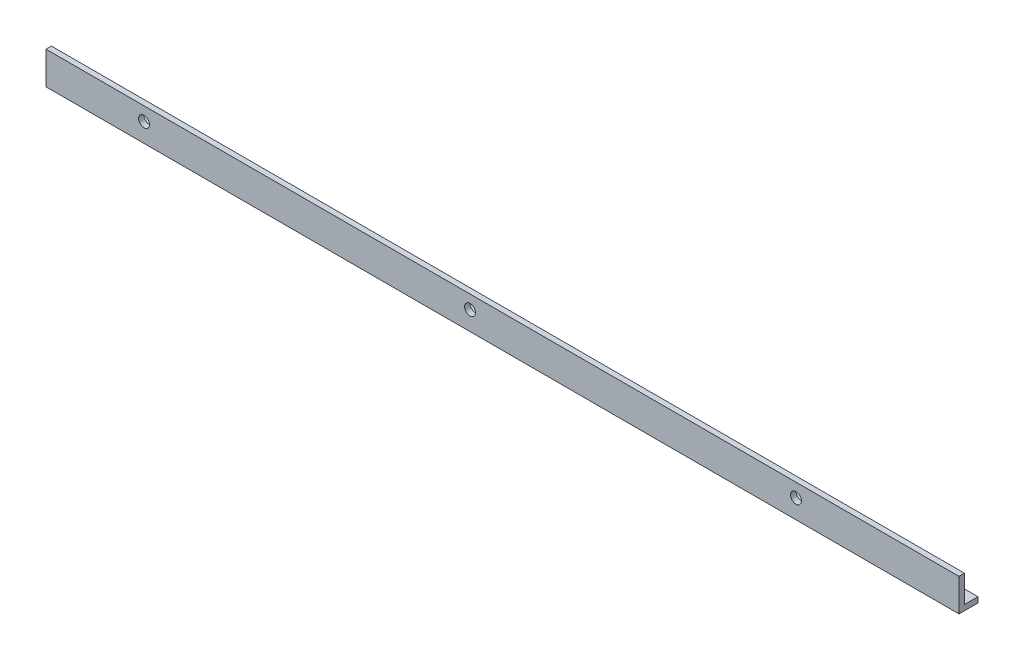
ISO-10303-21;
HEADER;
FILE_DESCRIPTION(('STEP AP214'),'2;1');
FILE_NAME('part.step','',(''),(''),'','','');
FILE_SCHEMA(('AUTOMOTIVE_DESIGN { 1 0 10303 214 1 1 1 1 }'));
ENDSEC;
DATA;
#1=APPLICATION_CONTEXT('core data for automotive mechanical design processes');
#2=APPLICATION_PROTOCOL_DEFINITION('international standard','automotive_design',2000,#1);
#3=PRODUCT_CONTEXT('',#1,'mechanical');
#4=PRODUCT('Part','Part','',(#3));
#5=PRODUCT_RELATED_PRODUCT_CATEGORY('part','',(#4));
#6=PRODUCT_DEFINITION_FORMATION('','',#4);
#7=PRODUCT_DEFINITION_CONTEXT('part definition',#1,'design');
#8=PRODUCT_DEFINITION('design','',#6,#7);
#9=PRODUCT_DEFINITION_SHAPE('','',#8);
#10=(LENGTH_UNIT() NAMED_UNIT(*) SI_UNIT(.MILLI.,.METRE.));
#11=(NAMED_UNIT(*) PLANE_ANGLE_UNIT() SI_UNIT($,.RADIAN.));
#12=(NAMED_UNIT(*) SI_UNIT($,.STERADIAN.) SOLID_ANGLE_UNIT());
#13=UNCERTAINTY_MEASURE_WITH_UNIT(LENGTH_MEASURE(1.E-05),#10,'distance_accuracy_value','');
#14=(GEOMETRIC_REPRESENTATION_CONTEXT(3) GLOBAL_UNCERTAINTY_ASSIGNED_CONTEXT((#13)) GLOBAL_UNIT_ASSIGNED_CONTEXT((#10,
#11,#12)) REPRESENTATION_CONTEXT('',''));
#15=CARTESIAN_POINT('',(0.,0.,0.));
#16=DIRECTION('',(0.,0.,1.));
#17=DIRECTION('',(1.,0.,0.));
#18=AXIS2_PLACEMENT_3D('',#15,#16,#17);
#19=CARTESIAN_POINT('',(0.,0.,0.));
#20=DIRECTION('',(0.,0.,1.));
#21=DIRECTION('',(1.,0.,0.));
#22=AXIS2_PLACEMENT_3D('',#19,#20,#21);
#23=PLANE('',#22);
#24=CARTESIAN_POINT('',(-39.88,1.98,0.));
#25=DIRECTION('',(0.,0.,-1.));
#26=DIRECTION('',(-1.,0.,0.));
#27=AXIS2_PLACEMENT_3D('',#24,#25,#26);
#28=CIRCLE('',#27,0.999999999999998);
#29=CARTESIAN_POINT('',(-40.88,1.98,0.));
#30=VERTEX_POINT('',#29);
#31=EDGE_CURVE('E124',#30,#30,#28,.T.);
#32=ORIENTED_EDGE('',*,*,#31,.F.);
#33=EDGE_LOOP('',(#32));
#34=FACE_BOUND('',#33,.T.);
#35=CARTESIAN_POINT('',(20.12,1.98,0.));
#36=DIRECTION('',(0.,0.,1.));
#37=DIRECTION('',(1.,0.,0.));
#38=AXIS2_PLACEMENT_3D('',#35,#36,#37);
#39=CIRCLE('',#38,1.);
#40=CARTESIAN_POINT('',(21.12,1.98,0.));
#41=VERTEX_POINT('',#40);
#42=EDGE_CURVE('E156',#41,#41,#39,.T.);
#43=ORIENTED_EDGE('',*,*,#42,.T.);
#44=EDGE_LOOP('',(#43));
#45=FACE_BOUND('',#44,.T.);
#46=CARTESIAN_POINT('',(80.12,1.98,0.));
#47=DIRECTION('',(0.,0.,1.));
#48=DIRECTION('',(1.,0.,0.));
#49=AXIS2_PLACEMENT_3D('',#46,#47,#48);
#50=CIRCLE('',#49,0.999999999999998);
#51=CARTESIAN_POINT('',(81.12,1.98,0.));
#52=VERTEX_POINT('',#51);
#53=EDGE_CURVE('E149',#52,#52,#50,.T.);
#54=ORIENTED_EDGE('',*,*,#53,.T.);
#55=EDGE_LOOP('',(#54));
#56=FACE_BOUND('',#55,.T.);
#57=DIRECTION('',(1.,0.,0.));
#58=VECTOR('',#57,1.);
#59=CARTESIAN_POINT('',(50.12,-0.519999999999996,0.));
#60=LINE('',#59,#58);
#61=CARTESIAN_POINT('',(-57.93,-0.519999999999996,0.));
#62=VERTEX_POINT('',#61);
#63=CARTESIAN_POINT('',(110.12,-0.519999999999996,0.));
#64=VERTEX_POINT('',#63);
#65=EDGE_CURVE('E52',#62,#64,#60,.T.);
#66=ORIENTED_EDGE('',*,*,#65,.F.);
#67=DIRECTION('',(0.,-1.,0.));
#68=VECTOR('',#67,1.);
#69=CARTESIAN_POINT('',(-57.93,4.48,0.));
#70=LINE('',#69,#68);
#71=CARTESIAN_POINT('',(-57.93,4.48,0.));
#72=VERTEX_POINT('',#71);
#73=EDGE_CURVE('E103',#72,#62,#70,.T.);
#74=ORIENTED_EDGE('',*,*,#73,.F.);
#75=DIRECTION('',(-1.,0.,0.));
#76=VECTOR('',#75,1.);
#77=CARTESIAN_POINT('',(-9.87999999999999,4.48,0.));
#78=LINE('',#77,#76);
#79=CARTESIAN_POINT('',(110.12,4.48,0.));
#80=VERTEX_POINT('',#79);
#81=EDGE_CURVE('E168',#80,#72,#78,.T.);
#82=ORIENTED_EDGE('',*,*,#81,.F.);
#83=DIRECTION('',(0.,1.,0.));
#84=VECTOR('',#83,1.);
#85=CARTESIAN_POINT('',(110.12,8.48000000000001,0.));
#86=LINE('',#85,#84);
#87=EDGE_CURVE('E180',#64,#80,#86,.T.);
#88=ORIENTED_EDGE('',*,*,#87,.F.);
#89=EDGE_LOOP('',(#66,#74,#82,#88));
#90=FACE_BOUND('',#89,.T.);
#91=ADVANCED_FACE('F43',(#34,#45,#56,#90),#23,.F.);
#92=CARTESIAN_POINT('',(-14.6,-1.52,1.));
#93=DIRECTION('',(0.,1.,0.));
#94=DIRECTION('',(0.,0.,1.));
#95=AXIS2_PLACEMENT_3D('',#92,#93,#94);
#96=PLANE('',#95);
#97=DIRECTION('',(1.,0.,0.));
#98=VECTOR('',#97,1.);
#99=CARTESIAN_POINT('',(-14.6,-1.52,1.));
#100=LINE('',#99,#98);
#101=CARTESIAN_POINT('',(-57.93,-1.52,1.00000000000001));
#102=VERTEX_POINT('',#101);
#103=CARTESIAN_POINT('',(110.12,-1.52,1.));
#104=VERTEX_POINT('',#103);
#105=EDGE_CURVE('E11',#102,#104,#100,.T.);
#106=ORIENTED_EDGE('',*,*,#105,.F.);
#107=DIRECTION('',(0.,0.,1.));
#108=VECTOR('',#107,1.);
#109=CARTESIAN_POINT('',(-57.93,-1.52,-2.5));
#110=LINE('',#109,#108);
#111=CARTESIAN_POINT('',(-57.93,-1.52,-2.5));
#112=VERTEX_POINT('',#111);
#113=EDGE_CURVE('E113',#112,#102,#110,.T.);
#114=ORIENTED_EDGE('',*,*,#113,.F.);
#115=DIRECTION('',(1.,0.,0.));
#116=VECTOR('',#115,1.);
#117=CARTESIAN_POINT('',(-9.87999999999999,-1.52,-2.5));
#118=LINE('',#117,#116);
#119=CARTESIAN_POINT('',(110.12,-1.52,-2.5));
#120=VERTEX_POINT('',#119);
#121=EDGE_CURVE('E102',#112,#120,#118,.T.);
#122=ORIENTED_EDGE('',*,*,#121,.T.);
#123=DIRECTION('',(0.,0.,-1.));
#124=VECTOR('',#123,1.);
#125=CARTESIAN_POINT('',(110.12,-1.52,-5.));
#126=LINE('',#125,#124);
#127=EDGE_CURVE('E174',#104,#120,#126,.T.);
#128=ORIENTED_EDGE('',*,*,#127,.F.);
#129=EDGE_LOOP('',(#106,#114,#122,#128));
#130=FACE_BOUND('',#129,.T.);
#131=ADVANCED_FACE('F45',(#130),#96,.F.);
#132=CARTESIAN_POINT('',(0.,0.,1.));
#133=DIRECTION('',(0.,0.,1.));
#134=DIRECTION('',(1.,0.,0.));
#135=AXIS2_PLACEMENT_3D('',#132,#133,#134);
#136=PLANE('',#135);
#137=CARTESIAN_POINT('',(-39.88,1.98,1.00000000000001));
#138=DIRECTION('',(0.,0.,-1.));
#139=DIRECTION('',(-1.,0.,0.));
#140=AXIS2_PLACEMENT_3D('',#137,#138,#139);
#141=CIRCLE('',#140,0.999999999999998);
#142=CARTESIAN_POINT('',(-40.88,1.98,1.00000000000001));
#143=VERTEX_POINT('',#142);
#144=EDGE_CURVE('E120',#143,#143,#141,.T.);
#145=ORIENTED_EDGE('',*,*,#144,.T.);
#146=EDGE_LOOP('',(#145));
#147=FACE_BOUND('',#146,.T.);
#148=CARTESIAN_POINT('',(20.12,1.98,1.));
#149=DIRECTION('',(0.,0.,1.));
#150=DIRECTION('',(1.,0.,0.));
#151=AXIS2_PLACEMENT_3D('',#148,#149,#150);
#152=CIRCLE('',#151,1.);
#153=CARTESIAN_POINT('',(21.12,1.98,1.));
#154=VERTEX_POINT('',#153);
#155=EDGE_CURVE('E145',#154,#154,#152,.T.);
#156=ORIENTED_EDGE('',*,*,#155,.F.);
#157=EDGE_LOOP('',(#156));
#158=FACE_BOUND('',#157,.T.);
#159=CARTESIAN_POINT('',(80.12,1.98,1.));
#160=DIRECTION('',(0.,0.,1.));
#161=DIRECTION('',(1.,0.,0.));
#162=AXIS2_PLACEMENT_3D('',#159,#160,#161);
#163=CIRCLE('',#162,0.999999999999998);
#164=CARTESIAN_POINT('',(81.12,1.98,1.));
#165=VERTEX_POINT('',#164);
#166=EDGE_CURVE('E144',#165,#165,#163,.T.);
#167=ORIENTED_EDGE('',*,*,#166,.F.);
#168=EDGE_LOOP('',(#167));
#169=FACE_BOUND('',#168,.T.);
#170=DIRECTION('',(1.,0.,0.));
#171=VECTOR('',#170,1.);
#172=CARTESIAN_POINT('',(-9.87999999999999,4.48,1.));
#173=LINE('',#172,#171);
#174=CARTESIAN_POINT('',(-57.93,4.48,1.));
#175=VERTEX_POINT('',#174);
#176=CARTESIAN_POINT('',(110.12,4.48,1.));
#177=VERTEX_POINT('',#176);
#178=EDGE_CURVE('E160',#175,#177,#173,.T.);
#179=ORIENTED_EDGE('',*,*,#178,.F.);
#180=DIRECTION('',(0.,1.,0.));
#181=VECTOR('',#180,1.);
#182=CARTESIAN_POINT('',(-57.93,-1.52,1.00000000000001));
#183=LINE('',#182,#181);
#184=EDGE_CURVE('E130',#102,#175,#183,.T.);
#185=ORIENTED_EDGE('',*,*,#184,.F.);
#186=ORIENTED_EDGE('',*,*,#105,.T.);
#187=DIRECTION('',(0.,-1.,0.));
#188=VECTOR('',#187,1.);
#189=CARTESIAN_POINT('',(110.12,-1.52,1.));
#190=LINE('',#189,#188);
#191=EDGE_CURVE('E171',#177,#104,#190,.T.);
#192=ORIENTED_EDGE('',*,*,#191,.F.);
#193=EDGE_LOOP('',(#179,#185,#186,#192));
#194=FACE_BOUND('',#193,.T.);
#195=ADVANCED_FACE('F191',(#147,#158,#169,#194),#136,.T.);
#196=CARTESIAN_POINT('',(50.12,-0.519999999999996,-5.));
#197=DIRECTION('',(0.,-1.,0.));
#198=DIRECTION('',(1.,0.,0.));
#199=AXIS2_PLACEMENT_3D('',#196,#197,#198);
#200=PLANE('',#199);
#201=DIRECTION('',(0.,0.,1.));
#202=VECTOR('',#201,1.);
#203=CARTESIAN_POINT('',(110.12,-0.519999999999996,0.));
#204=LINE('',#203,#202);
#205=CARTESIAN_POINT('',(110.12,-0.519999999999996,-2.5));
#206=VERTEX_POINT('',#205);
#207=EDGE_CURVE('E59',#206,#64,#204,.T.);
#208=ORIENTED_EDGE('',*,*,#207,.F.);
#209=DIRECTION('',(1.,0.,0.));
#210=VECTOR('',#209,1.);
#211=CARTESIAN_POINT('',(-9.87999999999999,-0.519999999999996,-2.5));
#212=LINE('',#211,#210);
#213=CARTESIAN_POINT('',(-57.93,-0.519999999999996,-2.5));
#214=VERTEX_POINT('',#213);
#215=EDGE_CURVE('E95',#214,#206,#212,.T.);
#216=ORIENTED_EDGE('',*,*,#215,.F.);
#217=DIRECTION('',(0.,0.,-1.));
#218=VECTOR('',#217,1.);
#219=CARTESIAN_POINT('',(-57.93,-0.519999999999996,0.));
#220=LINE('',#219,#218);
#221=EDGE_CURVE('E99',#62,#214,#220,.T.);
#222=ORIENTED_EDGE('',*,*,#221,.F.);
#223=ORIENTED_EDGE('',*,*,#65,.T.);
#224=EDGE_LOOP('',(#208,#216,#222,#223));
#225=FACE_BOUND('',#224,.T.);
#226=ADVANCED_FACE('F97',(#225),#200,.F.);
#227=CARTESIAN_POINT('',(110.12,0.,0.));
#228=DIRECTION('',(-1.,0.,0.));
#229=DIRECTION('',(0.,0.,1.));
#230=AXIS2_PLACEMENT_3D('',#227,#228,#229);
#231=PLANE('',#230);
#232=ORIENTED_EDGE('',*,*,#127,.T.);
#233=DIRECTION('',(0.,1.,0.));
#234=VECTOR('',#233,1.);
#235=CARTESIAN_POINT('',(110.12,-1.52,-2.5));
#236=LINE('',#235,#234);
#237=EDGE_CURVE('E140',#120,#206,#236,.T.);
#238=ORIENTED_EDGE('',*,*,#237,.T.);
#239=ORIENTED_EDGE('',*,*,#207,.T.);
#240=ORIENTED_EDGE('',*,*,#87,.T.);
#241=DIRECTION('',(0.,0.,-1.));
#242=VECTOR('',#241,1.);
#243=CARTESIAN_POINT('',(110.12,4.48,0.));
#244=LINE('',#243,#242);
#245=EDGE_CURVE('E164',#177,#80,#244,.T.);
#246=ORIENTED_EDGE('',*,*,#245,.F.);
#247=ORIENTED_EDGE('',*,*,#191,.T.);
#248=EDGE_LOOP('',(#232,#238,#239,#240,#246,#247));
#249=FACE_BOUND('',#248,.T.);
#250=ADVANCED_FACE('F187',(#249),#231,.F.);
#251=CARTESIAN_POINT('',(0.,4.48,0.));
#252=DIRECTION('',(0.,1.,0.));
#253=DIRECTION('',(0.,0.,1.));
#254=AXIS2_PLACEMENT_3D('',#251,#252,#253);
#255=PLANE('',#254);
#256=ORIENTED_EDGE('',*,*,#81,.T.);
#257=DIRECTION('',(0.,0.,-1.));
#258=VECTOR('',#257,1.);
#259=CARTESIAN_POINT('',(-57.93,4.48,1.));
#260=LINE('',#259,#258);
#261=EDGE_CURVE('E134',#175,#72,#260,.T.);
#262=ORIENTED_EDGE('',*,*,#261,.F.);
#263=ORIENTED_EDGE('',*,*,#178,.T.);
#264=ORIENTED_EDGE('',*,*,#245,.T.);
#265=EDGE_LOOP('',(#256,#262,#263,#264));
#266=FACE_BOUND('',#265,.T.);
#267=ADVANCED_FACE('F189',(#266),#255,.T.);
#268=CARTESIAN_POINT('',(80.12,1.98,-5.));
#269=DIRECTION('',(0.,0.,1.));
#270=DIRECTION('',(1.,0.,0.));
#271=AXIS2_PLACEMENT_3D('',#268,#269,#270);
#272=CYLINDRICAL_SURFACE('',#271,0.999999999999998);
#273=ORIENTED_EDGE('',*,*,#166,.T.);
#274=EDGE_LOOP('',(#273));
#275=FACE_BOUND('',#274,.T.);
#276=ORIENTED_EDGE('',*,*,#53,.F.);
#277=EDGE_LOOP('',(#276));
#278=FACE_BOUND('',#277,.T.);
#279=ADVANCED_FACE('F214',(#275,#278),#272,.F.);
#280=CARTESIAN_POINT('',(20.12,1.98,-5.));
#281=DIRECTION('',(0.,0.,1.));
#282=DIRECTION('',(1.,0.,0.));
#283=AXIS2_PLACEMENT_3D('',#280,#281,#282);
#284=CYLINDRICAL_SURFACE('',#283,1.);
#285=ORIENTED_EDGE('',*,*,#155,.T.);
#286=EDGE_LOOP('',(#285));
#287=FACE_BOUND('',#286,.T.);
#288=ORIENTED_EDGE('',*,*,#42,.F.);
#289=EDGE_LOOP('',(#288));
#290=FACE_BOUND('',#289,.T.);
#291=ADVANCED_FACE('F217',(#287,#290),#284,.F.);
#292=CARTESIAN_POINT('',(-9.87999999999999,-1.52,-2.5));
#293=DIRECTION('',(0.,0.,1.));
#294=DIRECTION('',(1.,0.,0.));
#295=AXIS2_PLACEMENT_3D('',#292,#293,#294);
#296=PLANE('',#295);
#297=ORIENTED_EDGE('',*,*,#215,.T.);
#298=ORIENTED_EDGE('',*,*,#237,.F.);
#299=ORIENTED_EDGE('',*,*,#121,.F.);
#300=DIRECTION('',(0.,-1.,0.));
#301=VECTOR('',#300,1.);
#302=CARTESIAN_POINT('',(-57.93,-0.519999999999996,-2.5));
#303=LINE('',#302,#301);
#304=EDGE_CURVE('E106',#214,#112,#303,.T.);
#305=ORIENTED_EDGE('',*,*,#304,.F.);
#306=EDGE_LOOP('',(#297,#298,#299,#305));
#307=FACE_BOUND('',#306,.T.);
#308=ADVANCED_FACE('F107',(#307),#296,.F.);
#309=CARTESIAN_POINT('',(-57.93,0.,0.));
#310=DIRECTION('',(-1.,0.,0.));
#311=DIRECTION('',(0.,0.,1.));
#312=AXIS2_PLACEMENT_3D('',#309,#310,#311);
#313=PLANE('',#312);
#314=ORIENTED_EDGE('',*,*,#221,.T.);
#315=ORIENTED_EDGE('',*,*,#304,.T.);
#316=ORIENTED_EDGE('',*,*,#113,.T.);
#317=ORIENTED_EDGE('',*,*,#184,.T.);
#318=ORIENTED_EDGE('',*,*,#261,.T.);
#319=ORIENTED_EDGE('',*,*,#73,.T.);
#320=EDGE_LOOP('',(#314,#315,#316,#317,#318,#319));
#321=FACE_BOUND('',#320,.T.);
#322=ADVANCED_FACE('F116',(#321),#313,.T.);
#323=CARTESIAN_POINT('',(-39.88,1.98,1.00000000000001));
#324=DIRECTION('',(0.,0.,-1.));
#325=DIRECTION('',(-1.,0.,0.));
#326=AXIS2_PLACEMENT_3D('',#323,#324,#325);
#327=CYLINDRICAL_SURFACE('',#326,0.999999999999998);
#328=ORIENTED_EDGE('',*,*,#144,.F.);
#329=EDGE_LOOP('',(#328));
#330=FACE_BOUND('',#329,.T.);
#331=ORIENTED_EDGE('',*,*,#31,.T.);
#332=EDGE_LOOP('',(#331));
#333=FACE_BOUND('',#332,.T.);
#334=ADVANCED_FACE('F225',(#330,#333),#327,.F.);
#335=CLOSED_SHELL('',(#91,#131,#195,#226,#250,#267,#279,#291,#308,#322,#334));
#336=MANIFOLD_SOLID_BREP('B2',#335);
#337=ADVANCED_BREP_SHAPE_REPRESENTATION('',(#18,#336),#14);
#338=SHAPE_DEFINITION_REPRESENTATION(#9,#337);
ENDSEC;
END-ISO-10303-21;
